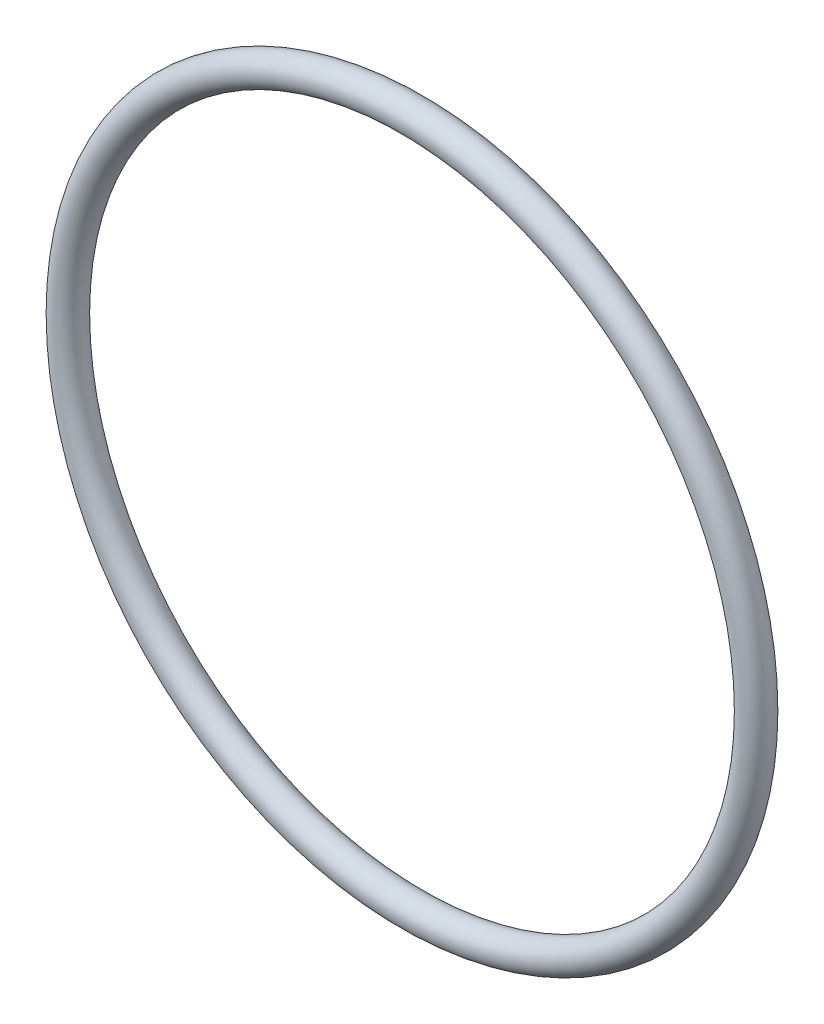
ISO-10303-21;
HEADER;
FILE_DESCRIPTION(('STEP AP214'),'2;1');
FILE_NAME('part.step','',(''),(''),'','','');
FILE_SCHEMA(('AUTOMOTIVE_DESIGN { 1 0 10303 214 1 1 1 1 }'));
ENDSEC;
DATA;
#1=APPLICATION_CONTEXT('core data for automotive mechanical design processes');
#2=APPLICATION_PROTOCOL_DEFINITION('international standard','automotive_design',2000,#1);
#3=PRODUCT_CONTEXT('',#1,'mechanical');
#4=PRODUCT('Part','Part','',(#3));
#5=PRODUCT_RELATED_PRODUCT_CATEGORY('part','',(#4));
#6=PRODUCT_DEFINITION_FORMATION('','',#4);
#7=PRODUCT_DEFINITION_CONTEXT('part definition',#1,'design');
#8=PRODUCT_DEFINITION('design','',#6,#7);
#9=PRODUCT_DEFINITION_SHAPE('','',#8);
#10=(LENGTH_UNIT() NAMED_UNIT(*) SI_UNIT(.MILLI.,.METRE.));
#11=(NAMED_UNIT(*) PLANE_ANGLE_UNIT() SI_UNIT($,.RADIAN.));
#12=(NAMED_UNIT(*) SI_UNIT($,.STERADIAN.) SOLID_ANGLE_UNIT());
#13=UNCERTAINTY_MEASURE_WITH_UNIT(LENGTH_MEASURE(1.E-05),#10,'distance_accuracy_value','');
#14=(GEOMETRIC_REPRESENTATION_CONTEXT(3) GLOBAL_UNCERTAINTY_ASSIGNED_CONTEXT((#13)) GLOBAL_UNIT_ASSIGNED_CONTEXT((#10,
#11,#12)) REPRESENTATION_CONTEXT('',''));
#15=CARTESIAN_POINT('',(0.,0.,0.));
#16=DIRECTION('',(0.,0.,1.));
#17=DIRECTION('',(1.,0.,0.));
#18=AXIS2_PLACEMENT_3D('',#15,#16,#17);
#19=CARTESIAN_POINT('',(0.,0.,0.));
#20=DIRECTION('',(0.,0.,1.));
#21=DIRECTION('',(1.,0.,0.));
#22=AXIS2_PLACEMENT_3D('',#19,#20,#21);
#23=TOROIDAL_SURFACE('',#22,36.46805,1.63195);
#24=CARTESIAN_POINT('',(36.46805,0.,0.));
#25=DIRECTION('',(0.,1.,0.));
#26=DIRECTION('',(0.,0.,1.));
#27=AXIS2_PLACEMENT_3D('',#24,#25,#26);
#28=CIRCLE('',#27,1.63195);
#29=CARTESIAN_POINT('',(38.1,0.,0.));
#30=VERTEX_POINT('',#29);
#31=EDGE_CURVE('E11',#30,#30,#28,.T.);
#32=CARTESIAN_POINT('',(0.,0.,0.));
#33=DIRECTION('',(0.,0.,1.));
#34=DIRECTION('',(1.,0.,0.));
#35=AXIS2_PLACEMENT_3D('',#32,#33,#34);
#36=CIRCLE('',#35,38.1);
#37=EDGE_CURVE('',#30,#30,#36,.T.);
#38=ORIENTED_EDGE('',*,*,#31,.T.);
#39=ORIENTED_EDGE('',*,*,#31,.F.);
#40=ORIENTED_EDGE('',*,*,#37,.T.);
#41=ORIENTED_EDGE('',*,*,#37,.F.);
#42=EDGE_LOOP('',(#38,#40,#39,#41));
#43=FACE_BOUND('',#42,.T.);
#44=ADVANCED_FACE('F40',(#43),#23,.T.);
#45=CLOSED_SHELL('',(#44));
#46=MANIFOLD_SOLID_BREP('B2',#45);
#47=ADVANCED_BREP_SHAPE_REPRESENTATION('',(#18,#46),#14);
#48=SHAPE_DEFINITION_REPRESENTATION(#9,#47);
ENDSEC;
END-ISO-10303-21;
